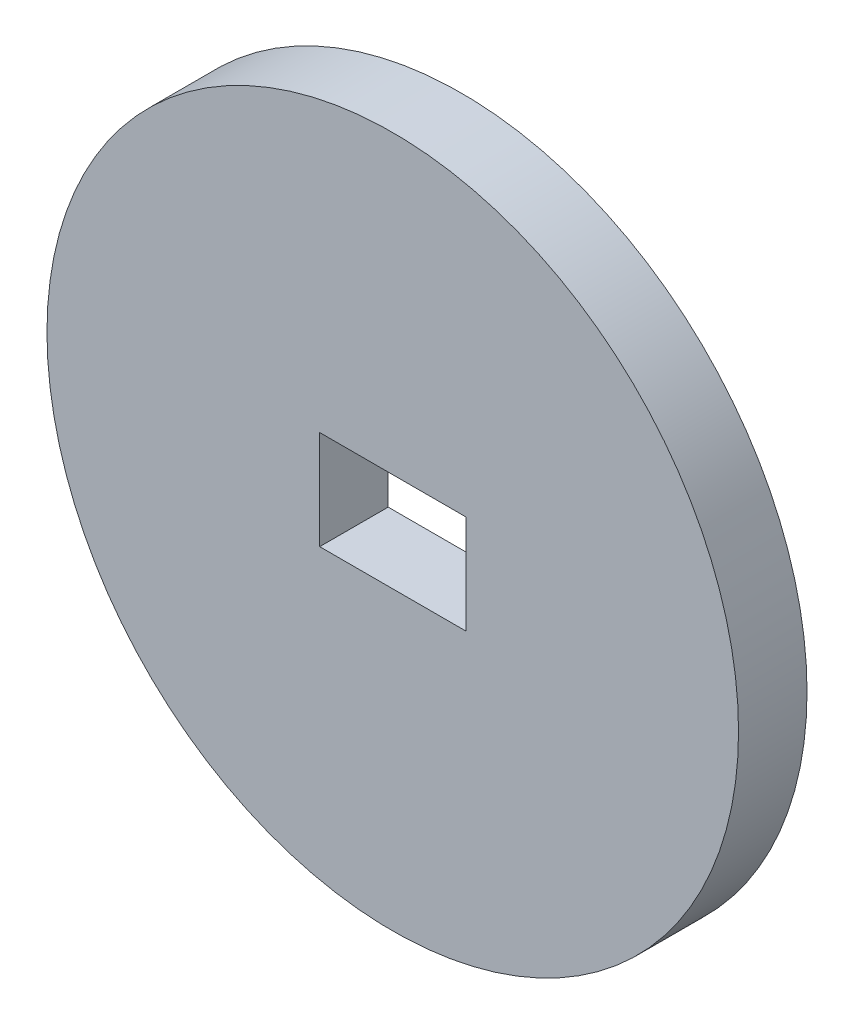
ISO-10303-21;
HEADER;
FILE_DESCRIPTION(('STEP AP214'),'2;1');
FILE_NAME('part.step','',(''),(''),'','','');
FILE_SCHEMA(('AUTOMOTIVE_DESIGN { 1 0 10303 214 1 1 1 1 }'));
ENDSEC;
DATA;
#1=APPLICATION_CONTEXT('core data for automotive mechanical design processes');
#2=APPLICATION_PROTOCOL_DEFINITION('international standard','automotive_design',2000,#1);
#3=PRODUCT_CONTEXT('',#1,'mechanical');
#4=PRODUCT('Part','Part','',(#3));
#5=PRODUCT_RELATED_PRODUCT_CATEGORY('part','',(#4));
#6=PRODUCT_DEFINITION_FORMATION('','',#4);
#7=PRODUCT_DEFINITION_CONTEXT('part definition',#1,'design');
#8=PRODUCT_DEFINITION('design','',#6,#7);
#9=PRODUCT_DEFINITION_SHAPE('','',#8);
#10=(LENGTH_UNIT() NAMED_UNIT(*) SI_UNIT(.MILLI.,.METRE.));
#11=(NAMED_UNIT(*) PLANE_ANGLE_UNIT() SI_UNIT($,.RADIAN.));
#12=(NAMED_UNIT(*) SI_UNIT($,.STERADIAN.) SOLID_ANGLE_UNIT());
#13=UNCERTAINTY_MEASURE_WITH_UNIT(LENGTH_MEASURE(1.E-05),#10,'distance_accuracy_value','');
#14=(GEOMETRIC_REPRESENTATION_CONTEXT(3) GLOBAL_UNCERTAINTY_ASSIGNED_CONTEXT((#13)) GLOBAL_UNIT_ASSIGNED_CONTEXT((#10,
#11,#12)) REPRESENTATION_CONTEXT('',''));
#15=CARTESIAN_POINT('',(0.,0.,0.));
#16=DIRECTION('',(0.,0.,1.));
#17=DIRECTION('',(1.,0.,0.));
#18=AXIS2_PLACEMENT_3D('',#15,#16,#17);
#19=CARTESIAN_POINT('',(0.,0.,2.55));
#20=DIRECTION('',(0.,0.,1.));
#21=DIRECTION('',(1.,0.,0.));
#22=AXIS2_PLACEMENT_3D('',#19,#20,#21);
#23=PLANE('',#22);
#24=CARTESIAN_POINT('',(0.,0.,2.55));
#25=DIRECTION('',(0.,0.,1.));
#26=DIRECTION('',(1.,0.,0.));
#27=AXIS2_PLACEMENT_3D('',#24,#25,#26);
#28=CIRCLE('',#27,12.875);
#29=CARTESIAN_POINT('',(12.875,0.,2.55));
#30=VERTEX_POINT('',#29);
#31=EDGE_CURVE('E11',#30,#30,#28,.T.);
#32=ORIENTED_EDGE('',*,*,#31,.T.);
#33=EDGE_LOOP('',(#32));
#34=FACE_BOUND('',#33,.T.);
#35=DIRECTION('',(-1.,0.,0.));
#36=VECTOR('',#35,1.);
#37=CARTESIAN_POINT('',(-2.72,1.84,2.55));
#38=LINE('',#37,#36);
#39=CARTESIAN_POINT('',(2.72,1.84,2.55));
#40=VERTEX_POINT('',#39);
#41=CARTESIAN_POINT('',(-2.72,1.84,2.55));
#42=VERTEX_POINT('',#41);
#43=EDGE_CURVE('E89',#40,#42,#38,.T.);
#44=ORIENTED_EDGE('',*,*,#43,.F.);
#45=DIRECTION('',(0.,1.,0.));
#46=VECTOR('',#45,1.);
#47=CARTESIAN_POINT('',(2.72,-1.84,2.55));
#48=LINE('',#47,#46);
#49=CARTESIAN_POINT('',(2.72,-1.84,2.55));
#50=VERTEX_POINT('',#49);
#51=EDGE_CURVE('E95',#50,#40,#48,.T.);
#52=ORIENTED_EDGE('',*,*,#51,.F.);
#53=DIRECTION('',(1.,0.,0.));
#54=VECTOR('',#53,1.);
#55=CARTESIAN_POINT('',(-2.72,-1.84,2.55));
#56=LINE('',#55,#54);
#57=CARTESIAN_POINT('',(-2.72,-1.84,2.55));
#58=VERTEX_POINT('',#57);
#59=EDGE_CURVE('E102',#58,#50,#56,.T.);
#60=ORIENTED_EDGE('',*,*,#59,.F.);
#61=DIRECTION('',(0.,-1.,0.));
#62=VECTOR('',#61,1.);
#63=CARTESIAN_POINT('',(-2.72,-1.84,2.55));
#64=LINE('',#63,#62);
#65=EDGE_CURVE('E59',#42,#58,#64,.T.);
#66=ORIENTED_EDGE('',*,*,#65,.F.);
#67=EDGE_LOOP('',(#44,#52,#60,#66));
#68=FACE_BOUND('',#67,.T.);
#69=ADVANCED_FACE('F43',(#34,#68),#23,.T.);
#70=CARTESIAN_POINT('',(0.,0.,0.));
#71=DIRECTION('',(0.,0.,1.));
#72=DIRECTION('',(1.,0.,0.));
#73=AXIS2_PLACEMENT_3D('',#70,#71,#72);
#74=PLANE('',#73);
#75=CARTESIAN_POINT('',(0.,0.,0.));
#76=DIRECTION('',(0.,0.,1.));
#77=DIRECTION('',(1.,0.,0.));
#78=AXIS2_PLACEMENT_3D('',#75,#76,#77);
#79=CIRCLE('',#78,12.875);
#80=CARTESIAN_POINT('',(12.875,0.,0.));
#81=VERTEX_POINT('',#80);
#82=EDGE_CURVE('E47',#81,#81,#79,.T.);
#83=ORIENTED_EDGE('',*,*,#82,.F.);
#84=EDGE_LOOP('',(#83));
#85=FACE_BOUND('',#84,.T.);
#86=DIRECTION('',(0.,1.,0.));
#87=VECTOR('',#86,1.);
#88=CARTESIAN_POINT('',(2.72,-1.84,0.));
#89=LINE('',#88,#87);
#90=CARTESIAN_POINT('',(2.72,-1.84,0.));
#91=VERTEX_POINT('',#90);
#92=CARTESIAN_POINT('',(2.72,1.84,0.));
#93=VERTEX_POINT('',#92);
#94=EDGE_CURVE('E67',#91,#93,#89,.T.);
#95=ORIENTED_EDGE('',*,*,#94,.T.);
#96=DIRECTION('',(-1.,0.,0.));
#97=VECTOR('',#96,1.);
#98=CARTESIAN_POINT('',(-2.72,1.84,0.));
#99=LINE('',#98,#97);
#100=CARTESIAN_POINT('',(-2.72,1.84,0.));
#101=VERTEX_POINT('',#100);
#102=EDGE_CURVE('E91',#93,#101,#99,.T.);
#103=ORIENTED_EDGE('',*,*,#102,.T.);
#104=DIRECTION('',(0.,-1.,0.));
#105=VECTOR('',#104,1.);
#106=CARTESIAN_POINT('',(-2.72,-1.84,0.));
#107=LINE('',#106,#105);
#108=CARTESIAN_POINT('',(-2.72,-1.84,0.));
#109=VERTEX_POINT('',#108);
#110=EDGE_CURVE('E116',#101,#109,#107,.T.);
#111=ORIENTED_EDGE('',*,*,#110,.T.);
#112=DIRECTION('',(1.,0.,0.));
#113=VECTOR('',#112,1.);
#114=CARTESIAN_POINT('',(-2.72,-1.84,0.));
#115=LINE('',#114,#113);
#116=EDGE_CURVE('E111',#109,#91,#115,.T.);
#117=ORIENTED_EDGE('',*,*,#116,.T.);
#118=EDGE_LOOP('',(#95,#103,#111,#117));
#119=FACE_BOUND('',#118,.T.);
#120=ADVANCED_FACE('F133',(#85,#119),#74,.F.);
#121=CARTESIAN_POINT('',(0.,0.,2.55));
#122=DIRECTION('',(0.,0.,-1.));
#123=DIRECTION('',(-1.,0.,0.));
#124=AXIS2_PLACEMENT_3D('',#121,#122,#123);
#125=CYLINDRICAL_SURFACE('',#124,12.875);
#126=ORIENTED_EDGE('',*,*,#31,.F.);
#127=EDGE_LOOP('',(#126));
#128=FACE_BOUND('',#127,.T.);
#129=ORIENTED_EDGE('',*,*,#82,.T.);
#130=EDGE_LOOP('',(#129));
#131=FACE_BOUND('',#130,.T.);
#132=ADVANCED_FACE('F45',(#128,#131),#125,.T.);
#133=CARTESIAN_POINT('',(2.72,-1.84,9.11780024056761));
#134=DIRECTION('',(-1.,0.,0.));
#135=DIRECTION('',(0.,0.,1.));
#136=AXIS2_PLACEMENT_3D('',#133,#134,#135);
#137=PLANE('',#136);
#138=ORIENTED_EDGE('',*,*,#51,.T.);
#139=DIRECTION('',(0.,0.,-1.));
#140=VECTOR('',#139,1.);
#141=CARTESIAN_POINT('',(2.72,1.84,9.11780024056761));
#142=LINE('',#141,#140);
#143=EDGE_CURVE('E85',#40,#93,#142,.T.);
#144=ORIENTED_EDGE('',*,*,#143,.T.);
#145=ORIENTED_EDGE('',*,*,#94,.F.);
#146=DIRECTION('',(0.,0.,-1.));
#147=VECTOR('',#146,1.);
#148=CARTESIAN_POINT('',(2.72,-1.84,9.11780024056761));
#149=LINE('',#148,#147);
#150=EDGE_CURVE('E97',#50,#91,#149,.T.);
#151=ORIENTED_EDGE('',*,*,#150,.F.);
#152=EDGE_LOOP('',(#138,#144,#145,#151));
#153=FACE_BOUND('',#152,.T.);
#154=ADVANCED_FACE('F96',(#153),#137,.T.);
#155=CARTESIAN_POINT('',(-2.72,1.84,9.11780024056761));
#156=DIRECTION('',(0.,-1.,0.));
#157=DIRECTION('',(0.,0.,-1.));
#158=AXIS2_PLACEMENT_3D('',#155,#156,#157);
#159=PLANE('',#158);
#160=ORIENTED_EDGE('',*,*,#43,.T.);
#161=DIRECTION('',(0.,0.,-1.));
#162=VECTOR('',#161,1.);
#163=CARTESIAN_POINT('',(-2.72,1.84,9.11780024056761));
#164=LINE('',#163,#162);
#165=EDGE_CURVE('E113',#42,#101,#164,.T.);
#166=ORIENTED_EDGE('',*,*,#165,.T.);
#167=ORIENTED_EDGE('',*,*,#102,.F.);
#168=ORIENTED_EDGE('',*,*,#143,.F.);
#169=EDGE_LOOP('',(#160,#166,#167,#168));
#170=FACE_BOUND('',#169,.T.);
#171=ADVANCED_FACE('F87',(#170),#159,.T.);
#172=CARTESIAN_POINT('',(-2.72,-1.84,9.11780024056761));
#173=DIRECTION('',(1.,0.,0.));
#174=DIRECTION('',(0.,0.,-1.));
#175=AXIS2_PLACEMENT_3D('',#172,#173,#174);
#176=PLANE('',#175);
#177=ORIENTED_EDGE('',*,*,#65,.T.);
#178=DIRECTION('',(0.,0.,-1.));
#179=VECTOR('',#178,1.);
#180=CARTESIAN_POINT('',(-2.72,-1.84,9.11780024056761));
#181=LINE('',#180,#179);
#182=EDGE_CURVE('E117',#58,#109,#181,.T.);
#183=ORIENTED_EDGE('',*,*,#182,.T.);
#184=ORIENTED_EDGE('',*,*,#110,.F.);
#185=ORIENTED_EDGE('',*,*,#165,.F.);
#186=EDGE_LOOP('',(#177,#183,#184,#185));
#187=FACE_BOUND('',#186,.T.);
#188=ADVANCED_FACE('F136',(#187),#176,.T.);
#189=CARTESIAN_POINT('',(-2.72,-1.84,9.11780024056761));
#190=DIRECTION('',(0.,1.,0.));
#191=DIRECTION('',(0.,0.,1.));
#192=AXIS2_PLACEMENT_3D('',#189,#190,#191);
#193=PLANE('',#192);
#194=ORIENTED_EDGE('',*,*,#59,.T.);
#195=ORIENTED_EDGE('',*,*,#150,.T.);
#196=ORIENTED_EDGE('',*,*,#116,.F.);
#197=ORIENTED_EDGE('',*,*,#182,.F.);
#198=EDGE_LOOP('',(#194,#195,#196,#197));
#199=FACE_BOUND('',#198,.T.);
#200=ADVANCED_FACE('F135',(#199),#193,.T.);
#201=CLOSED_SHELL('',(#69,#120,#132,#154,#171,#188,#200));
#202=MANIFOLD_SOLID_BREP('B2',#201);
#203=ADVANCED_BREP_SHAPE_REPRESENTATION('',(#18,#202),#14);
#204=SHAPE_DEFINITION_REPRESENTATION(#9,#203);
ENDSEC;
END-ISO-10303-21;
